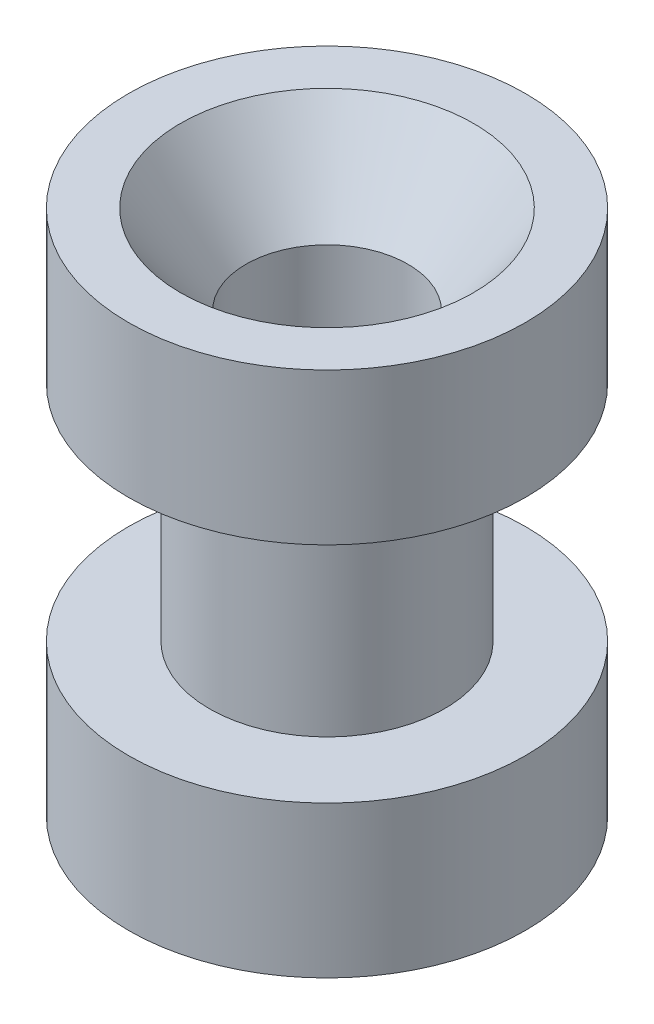
ISO-10303-21;
HEADER;
FILE_DESCRIPTION(('STEP AP214'),'2;1');
FILE_NAME('part.step','',(''),(''),'','','');
FILE_SCHEMA(('AUTOMOTIVE_DESIGN { 1 0 10303 214 1 1 1 1 }'));
ENDSEC;
DATA;
#1=APPLICATION_CONTEXT('core data for automotive mechanical design processes');
#2=APPLICATION_PROTOCOL_DEFINITION('international standard','automotive_design',2000,#1);
#3=PRODUCT_CONTEXT('',#1,'mechanical');
#4=PRODUCT('Part','Part','',(#3));
#5=PRODUCT_RELATED_PRODUCT_CATEGORY('part','',(#4));
#6=PRODUCT_DEFINITION_FORMATION('','',#4);
#7=PRODUCT_DEFINITION_CONTEXT('part definition',#1,'design');
#8=PRODUCT_DEFINITION('design','',#6,#7);
#9=PRODUCT_DEFINITION_SHAPE('','',#8);
#10=(LENGTH_UNIT() NAMED_UNIT(*) SI_UNIT(.MILLI.,.METRE.));
#11=(NAMED_UNIT(*) PLANE_ANGLE_UNIT() SI_UNIT($,.RADIAN.));
#12=(NAMED_UNIT(*) SI_UNIT($,.STERADIAN.) SOLID_ANGLE_UNIT());
#13=UNCERTAINTY_MEASURE_WITH_UNIT(LENGTH_MEASURE(1.E-05),#10,'distance_accuracy_value','');
#14=(GEOMETRIC_REPRESENTATION_CONTEXT(3) GLOBAL_UNCERTAINTY_ASSIGNED_CONTEXT((#13)) GLOBAL_UNIT_ASSIGNED_CONTEXT((#10,
#11,#12)) REPRESENTATION_CONTEXT('',''));
#15=CARTESIAN_POINT('',(0.,0.,0.));
#16=DIRECTION('',(0.,0.,1.));
#17=DIRECTION('',(1.,0.,0.));
#18=AXIS2_PLACEMENT_3D('',#15,#16,#17);
#19=CARTESIAN_POINT('',(0.,-7.18420489685533,0.));
#20=DIRECTION('',(0.,1.,0.));
#21=DIRECTION('',(0.,0.,1.));
#22=AXIS2_PLACEMENT_3D('',#19,#20,#21);
#23=CYLINDRICAL_SURFACE('',#22,2.54);
#24=CARTESIAN_POINT('',(0.,0.,0.));
#25=DIRECTION('',(0.,1.,0.));
#26=DIRECTION('',(0.,0.,1.));
#27=AXIS2_PLACEMENT_3D('',#24,#25,#26);
#28=CIRCLE('',#27,2.54);
#29=CARTESIAN_POINT('',(0.,0.,2.54));
#30=VERTEX_POINT('',#29);
#31=EDGE_CURVE('E58',#30,#30,#28,.F.);
#32=ORIENTED_EDGE('',*,*,#31,.T.);
#33=EDGE_LOOP('',(#32));
#34=FACE_BOUND('',#33,.T.);
#35=CARTESIAN_POINT('',(0.,13.716,0.));
#36=DIRECTION('',(0.,1.,0.));
#37=DIRECTION('',(0.,0.,1.));
#38=AXIS2_PLACEMENT_3D('',#35,#36,#37);
#39=CIRCLE('',#38,2.54);
#40=CARTESIAN_POINT('',(0.,13.716,2.54));
#41=VERTEX_POINT('',#40);
#42=EDGE_CURVE('E63',#41,#41,#39,.T.);
#43=ORIENTED_EDGE('',*,*,#42,.T.);
#44=EDGE_LOOP('',(#43));
#45=FACE_BOUND('',#44,.T.);
#46=ADVANCED_FACE('F37',(#34,#45),#23,.F.);
#47=CARTESIAN_POINT('',(0.,4.7498,0.));
#48=DIRECTION('',(0.,-1.,0.));
#49=DIRECTION('',(0.,0.,-1.));
#50=AXIS2_PLACEMENT_3D('',#47,#48,#49);
#51=CYLINDRICAL_SURFACE('',#50,6.223);
#52=CARTESIAN_POINT('',(0.,4.7498,0.));
#53=DIRECTION('',(0.,1.,0.));
#54=DIRECTION('',(0.,0.,1.));
#55=AXIS2_PLACEMENT_3D('',#52,#53,#54);
#56=CIRCLE('',#55,6.223);
#57=CARTESIAN_POINT('',(0.,4.7498,6.223));
#58=VERTEX_POINT('',#57);
#59=EDGE_CURVE('E45',#58,#58,#56,.T.);
#60=ORIENTED_EDGE('',*,*,#59,.F.);
#61=EDGE_LOOP('',(#60));
#62=FACE_BOUND('',#61,.T.);
#63=CARTESIAN_POINT('',(0.,0.,0.));
#64=DIRECTION('',(0.,1.,0.));
#65=DIRECTION('',(0.,0.,1.));
#66=AXIS2_PLACEMENT_3D('',#63,#64,#65);
#67=CIRCLE('',#66,6.223);
#68=CARTESIAN_POINT('',(0.,0.,6.223));
#69=VERTEX_POINT('',#68);
#70=EDGE_CURVE('E41',#69,#69,#67,.T.);
#71=ORIENTED_EDGE('',*,*,#70,.T.);
#72=EDGE_LOOP('',(#71));
#73=FACE_BOUND('',#72,.T.);
#74=ADVANCED_FACE('F39',(#62,#73),#51,.T.);
#75=CARTESIAN_POINT('',(0.,4.7498,0.));
#76=DIRECTION('',(0.,1.,0.));
#77=DIRECTION('',(0.,0.,1.));
#78=AXIS2_PLACEMENT_3D('',#75,#76,#77);
#79=PLANE('',#78);
#80=CARTESIAN_POINT('',(0.,4.7498,0.));
#81=DIRECTION('',(0.,1.,0.));
#82=DIRECTION('',(0.,0.,1.));
#83=AXIS2_PLACEMENT_3D('',#80,#81,#82);
#84=CIRCLE('',#83,3.683);
#85=CARTESIAN_POINT('',(0.,4.7498,3.683));
#86=VERTEX_POINT('',#85);
#87=EDGE_CURVE('E10',#86,#86,#84,.T.);
#88=ORIENTED_EDGE('',*,*,#87,.F.);
#89=EDGE_LOOP('',(#88));
#90=FACE_BOUND('',#89,.T.);
#91=ORIENTED_EDGE('',*,*,#59,.T.);
#92=EDGE_LOOP('',(#91));
#93=FACE_BOUND('',#92,.T.);
#94=ADVANCED_FACE('F100',(#90,#93),#79,.T.);
#95=CARTESIAN_POINT('',(0.,0.,0.));
#96=DIRECTION('',(0.,1.,0.));
#97=DIRECTION('',(0.,0.,1.));
#98=AXIS2_PLACEMENT_3D('',#95,#96,#97);
#99=PLANE('',#98);
#100=ORIENTED_EDGE('',*,*,#31,.F.);
#101=EDGE_LOOP('',(#100));
#102=FACE_BOUND('',#101,.T.);
#103=ORIENTED_EDGE('',*,*,#70,.F.);
#104=EDGE_LOOP('',(#103));
#105=FACE_BOUND('',#104,.T.);
#106=ADVANCED_FACE('F106',(#102,#105),#99,.F.);
#107=CARTESIAN_POINT('',(0.,11.7602,0.));
#108=DIRECTION('',(0.,-1.,0.));
#109=DIRECTION('',(0.,0.,-1.));
#110=AXIS2_PLACEMENT_3D('',#107,#108,#109);
#111=CYLINDRICAL_SURFACE('',#110,3.683);
#112=CARTESIAN_POINT('',(0.,11.7602,0.));
#113=DIRECTION('',(0.,1.,0.));
#114=DIRECTION('',(0.,0.,1.));
#115=AXIS2_PLACEMENT_3D('',#112,#113,#114);
#116=CIRCLE('',#115,3.683);
#117=CARTESIAN_POINT('',(0.,11.7602,3.683));
#118=VERTEX_POINT('',#117);
#119=EDGE_CURVE('E51',#118,#118,#116,.T.);
#120=ORIENTED_EDGE('',*,*,#119,.F.);
#121=EDGE_LOOP('',(#120));
#122=FACE_BOUND('',#121,.T.);
#123=ORIENTED_EDGE('',*,*,#87,.T.);
#124=EDGE_LOOP('',(#123));
#125=FACE_BOUND('',#124,.T.);
#126=ADVANCED_FACE('F83',(#122,#125),#111,.T.);
#127=CARTESIAN_POINT('',(0.,16.51,0.));
#128=DIRECTION('',(0.,-1.,0.));
#129=DIRECTION('',(0.,0.,-1.));
#130=AXIS2_PLACEMENT_3D('',#127,#128,#129);
#131=CYLINDRICAL_SURFACE('',#130,6.223);
#132=CARTESIAN_POINT('',(0.,16.51,0.));
#133=DIRECTION('',(0.,1.,0.));
#134=DIRECTION('',(0.,0.,1.));
#135=AXIS2_PLACEMENT_3D('',#132,#133,#134);
#136=CIRCLE('',#135,6.223);
#137=CARTESIAN_POINT('',(0.,16.51,6.223));
#138=VERTEX_POINT('',#137);
#139=EDGE_CURVE('E54',#138,#138,#136,.T.);
#140=ORIENTED_EDGE('',*,*,#139,.F.);
#141=EDGE_LOOP('',(#140));
#142=FACE_BOUND('',#141,.T.);
#143=CARTESIAN_POINT('',(0.,11.7602,0.));
#144=DIRECTION('',(0.,1.,0.));
#145=DIRECTION('',(0.,0.,1.));
#146=AXIS2_PLACEMENT_3D('',#143,#144,#145);
#147=CIRCLE('',#146,6.223);
#148=CARTESIAN_POINT('',(0.,11.7602,6.223));
#149=VERTEX_POINT('',#148);
#150=EDGE_CURVE('E55',#149,#149,#147,.T.);
#151=ORIENTED_EDGE('',*,*,#150,.T.);
#152=EDGE_LOOP('',(#151));
#153=FACE_BOUND('',#152,.T.);
#154=ADVANCED_FACE('F77',(#142,#153),#131,.T.);
#155=CARTESIAN_POINT('',(0.,16.51,0.));
#156=DIRECTION('',(0.,1.,0.));
#157=DIRECTION('',(0.,0.,1.));
#158=AXIS2_PLACEMENT_3D('',#155,#156,#157);
#159=PLANE('',#158);
#160=CARTESIAN_POINT('',(0.,16.51,0.));
#161=DIRECTION('',(0.,1.,0.));
#162=DIRECTION('',(0.,0.,1.));
#163=AXIS2_PLACEMENT_3D('',#160,#161,#162);
#164=CIRCLE('',#163,4.5974);
#165=CARTESIAN_POINT('',(0.,16.51,4.5974));
#166=VERTEX_POINT('',#165);
#167=EDGE_CURVE('E66',#166,#166,#164,.T.);
#168=ORIENTED_EDGE('',*,*,#167,.F.);
#169=EDGE_LOOP('',(#168));
#170=FACE_BOUND('',#169,.T.);
#171=ORIENTED_EDGE('',*,*,#139,.T.);
#172=EDGE_LOOP('',(#171));
#173=FACE_BOUND('',#172,.T.);
#174=ADVANCED_FACE('F73',(#170,#173),#159,.T.);
#175=CARTESIAN_POINT('',(0.,11.7602,0.));
#176=DIRECTION('',(0.,1.,0.));
#177=DIRECTION('',(0.,0.,1.));
#178=AXIS2_PLACEMENT_3D('',#175,#176,#177);
#179=PLANE('',#178);
#180=ORIENTED_EDGE('',*,*,#119,.T.);
#181=EDGE_LOOP('',(#180));
#182=FACE_BOUND('',#181,.T.);
#183=ORIENTED_EDGE('',*,*,#150,.F.);
#184=EDGE_LOOP('',(#183));
#185=FACE_BOUND('',#184,.T.);
#186=ADVANCED_FACE('F76',(#182,#185),#179,.F.);
#187=CARTESIAN_POINT('',(0.,13.716,0.));
#188=DIRECTION('',(0.,1.,0.));
#189=DIRECTION('',(0.,0.,1.));
#190=AXIS2_PLACEMENT_3D('',#187,#188,#189);
#191=CONICAL_SURFACE('',#190,2.54,0.63471656170299);
#192=ORIENTED_EDGE('',*,*,#167,.T.);
#193=EDGE_LOOP('',(#192));
#194=FACE_BOUND('',#193,.T.);
#195=ORIENTED_EDGE('',*,*,#42,.F.);
#196=EDGE_LOOP('',(#195));
#197=FACE_BOUND('',#196,.T.);
#198=ADVANCED_FACE('F70',(#194,#197),#191,.F.);
#199=CLOSED_SHELL('',(#46,#74,#94,#106,#126,#154,#174,#186,#198));
#200=MANIFOLD_SOLID_BREP('B2',#199);
#201=ADVANCED_BREP_SHAPE_REPRESENTATION('',(#18,#200),#14);
#202=SHAPE_DEFINITION_REPRESENTATION(#9,#201);
ENDSEC;
END-ISO-10303-21;
